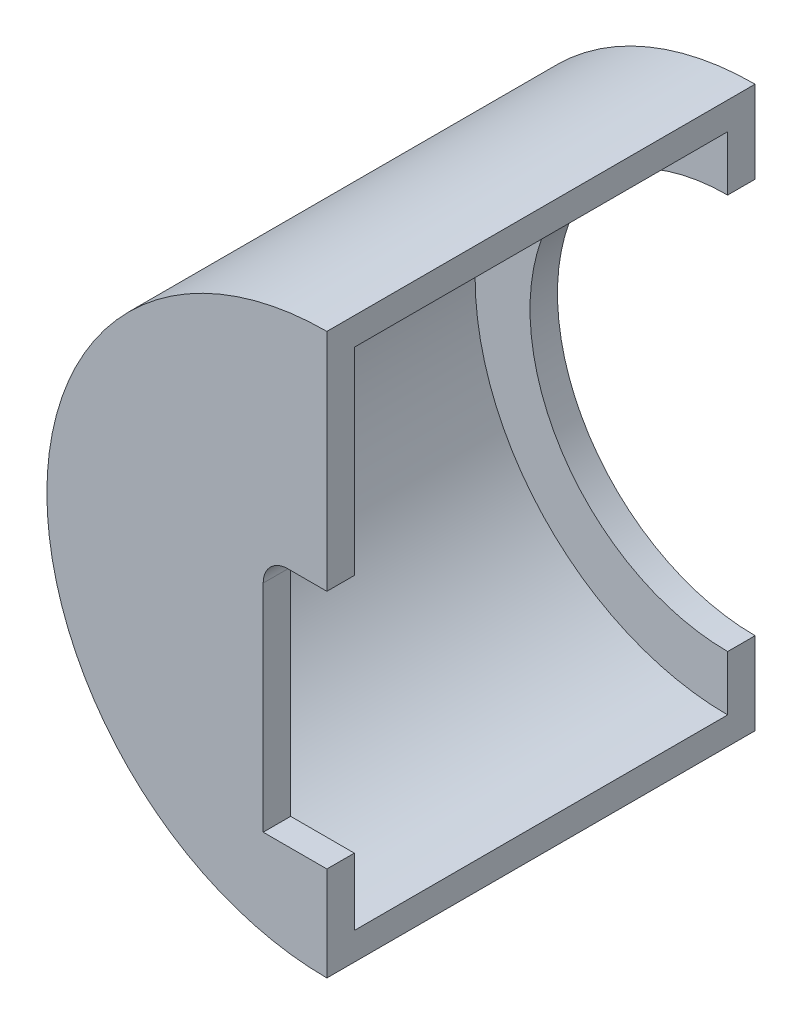
ISO-10303-21;
HEADER;
FILE_DESCRIPTION(('STEP AP214'),'2;1');
FILE_NAME('part.step','',(''),(''),'','','');
FILE_SCHEMA(('AUTOMOTIVE_DESIGN { 1 0 10303 214 1 1 1 1 }'));
ENDSEC;
DATA;
#1=APPLICATION_CONTEXT('core data for automotive mechanical design processes');
#2=APPLICATION_PROTOCOL_DEFINITION('international standard','automotive_design',2000,#1);
#3=PRODUCT_CONTEXT('',#1,'mechanical');
#4=PRODUCT('Part','Part','',(#3));
#5=PRODUCT_RELATED_PRODUCT_CATEGORY('part','',(#4));
#6=PRODUCT_DEFINITION_FORMATION('','',#4);
#7=PRODUCT_DEFINITION_CONTEXT('part definition',#1,'design');
#8=PRODUCT_DEFINITION('design','',#6,#7);
#9=PRODUCT_DEFINITION_SHAPE('','',#8);
#10=(LENGTH_UNIT() NAMED_UNIT(*) SI_UNIT(.MILLI.,.METRE.));
#11=(NAMED_UNIT(*) PLANE_ANGLE_UNIT() SI_UNIT($,.RADIAN.));
#12=(NAMED_UNIT(*) SI_UNIT($,.STERADIAN.) SOLID_ANGLE_UNIT());
#13=UNCERTAINTY_MEASURE_WITH_UNIT(LENGTH_MEASURE(1.E-05),#10,'distance_accuracy_value','');
#14=(GEOMETRIC_REPRESENTATION_CONTEXT(3) GLOBAL_UNCERTAINTY_ASSIGNED_CONTEXT((#13)) GLOBAL_UNIT_ASSIGNED_CONTEXT((#10,
#11,#12)) REPRESENTATION_CONTEXT('',''));
#15=CARTESIAN_POINT('',(0.,0.,0.));
#16=DIRECTION('',(0.,0.,1.));
#17=DIRECTION('',(1.,0.,0.));
#18=AXIS2_PLACEMENT_3D('',#15,#16,#17);
#19=CARTESIAN_POINT('',(0.,-46.,34.));
#20=DIRECTION('',(-1.,0.,0.));
#21=DIRECTION('',(0.,-1.,0.));
#22=AXIS2_PLACEMENT_3D('',#19,#20,#21);
#23=PLANE('',#22);
#24=DIRECTION('',(0.,0.,1.));
#25=VECTOR('',#24,1.);
#26=CARTESIAN_POINT('',(0.,10.000000044355,29.));
#27=LINE('',#26,#25);
#28=CARTESIAN_POINT('',(0.,10.000000044355,34.));
#29=VERTEX_POINT('',#28);
#30=CARTESIAN_POINT('',(0.,10.000000044355,39.));
#31=VERTEX_POINT('',#30);
#32=EDGE_CURVE('E79',#29,#31,#27,.T.);
#33=ORIENTED_EDGE('',*,*,#32,.F.);
#34=DIRECTION('',(0.,1.,0.));
#35=VECTOR('',#34,1.);
#36=CARTESIAN_POINT('',(0.,51.,34.));
#37=LINE('',#36,#35);
#38=CARTESIAN_POINT('',(0.,46.,34.));
#39=VERTEX_POINT('',#38);
#40=EDGE_CURVE('E65',#29,#39,#37,.T.);
#41=ORIENTED_EDGE('',*,*,#40,.T.);
#42=DIRECTION('',(0.,0.,-1.));
#43=VECTOR('',#42,1.);
#44=CARTESIAN_POINT('',(0.,46.,34.));
#45=LINE('',#44,#43);
#46=CARTESIAN_POINT('',(0.,46.,-34.));
#47=VERTEX_POINT('',#46);
#48=EDGE_CURVE('E12',#39,#47,#45,.T.);
#49=ORIENTED_EDGE('',*,*,#48,.T.);
#50=DIRECTION('',(0.,-1.,0.));
#51=VECTOR('',#50,1.);
#52=CARTESIAN_POINT('',(0.,51.,-34.));
#53=LINE('',#52,#51);
#54=CARTESIAN_POINT('',(0.,36.,-34.));
#55=VERTEX_POINT('',#54);
#56=EDGE_CURVE('E190',#47,#55,#53,.T.);
#57=ORIENTED_EDGE('',*,*,#56,.T.);
#58=DIRECTION('',(0.,0.,1.));
#59=VECTOR('',#58,1.);
#60=CARTESIAN_POINT('',(0.,36.,-39.));
#61=LINE('',#60,#59);
#62=CARTESIAN_POINT('',(0.,36.,-39.));
#63=VERTEX_POINT('',#62);
#64=EDGE_CURVE('E252',#63,#55,#61,.T.);
#65=ORIENTED_EDGE('',*,*,#64,.F.);
#66=DIRECTION('',(0.,-1.,0.));
#67=VECTOR('',#66,1.);
#68=CARTESIAN_POINT('',(0.,51.,-39.));
#69=LINE('',#68,#67);
#70=CARTESIAN_POINT('',(0.,51.,-39.));
#71=VERTEX_POINT('',#70);
#72=EDGE_CURVE('E194',#71,#63,#69,.T.);
#73=ORIENTED_EDGE('',*,*,#72,.F.);
#74=DIRECTION('',(0.,0.,-1.));
#75=VECTOR('',#74,1.);
#76=CARTESIAN_POINT('',(0.,51.,34.));
#77=LINE('',#76,#75);
#78=CARTESIAN_POINT('',(0.,51.,39.));
#79=VERTEX_POINT('',#78);
#80=EDGE_CURVE('E71',#79,#71,#77,.T.);
#81=ORIENTED_EDGE('',*,*,#80,.F.);
#82=DIRECTION('',(0.,1.,0.));
#83=VECTOR('',#82,1.);
#84=CARTESIAN_POINT('',(0.,51.,39.));
#85=LINE('',#84,#83);
#86=EDGE_CURVE('E214',#31,#79,#85,.T.);
#87=ORIENTED_EDGE('',*,*,#86,.F.);
#88=EDGE_LOOP('',(#33,#41,#49,#57,#65,#73,#81,#87));
#89=FACE_BOUND('',#88,.T.);
#90=ADVANCED_FACE('F61',(#89),#23,.F.);
#91=CARTESIAN_POINT('',(0.,-46.,34.));
#92=VERTEX_POINT('',#91);
#93=CARTESIAN_POINT('',(0.,-33.8,34.));
#94=VERTEX_POINT('',#93);
#95=EDGE_CURVE('E215',#92,#94,#37,.T.);
#96=ORIENTED_EDGE('',*,*,#95,.T.);
#97=DIRECTION('',(0.,0.,1.));
#98=VECTOR('',#97,1.);
#99=CARTESIAN_POINT('',(0.,-33.8,29.));
#100=LINE('',#99,#98);
#101=CARTESIAN_POINT('',(0.,-33.8,39.));
#102=VERTEX_POINT('',#101);
#103=EDGE_CURVE('E175',#94,#102,#100,.T.);
#104=ORIENTED_EDGE('',*,*,#103,.T.);
#105=CARTESIAN_POINT('',(0.,-51.,39.));
#106=VERTEX_POINT('',#105);
#107=EDGE_CURVE('E216',#106,#102,#85,.T.);
#108=ORIENTED_EDGE('',*,*,#107,.F.);
#109=DIRECTION('',(0.,0.,-1.));
#110=VECTOR('',#109,1.);
#111=CARTESIAN_POINT('',(0.,-51.,34.));
#112=LINE('',#111,#110);
#113=CARTESIAN_POINT('',(0.,-51.,-39.));
#114=VERTEX_POINT('',#113);
#115=EDGE_CURVE('E234',#106,#114,#112,.T.);
#116=ORIENTED_EDGE('',*,*,#115,.T.);
#117=DIRECTION('',(0.,-1.,0.));
#118=VECTOR('',#117,1.);
#119=CARTESIAN_POINT('',(0.,-51.,-39.));
#120=LINE('',#119,#118);
#121=CARTESIAN_POINT('',(0.,-36.,-39.));
#122=VERTEX_POINT('',#121);
#123=EDGE_CURVE('E199',#122,#114,#120,.T.);
#124=ORIENTED_EDGE('',*,*,#123,.F.);
#125=DIRECTION('',(0.,0.,1.));
#126=VECTOR('',#125,1.);
#127=CARTESIAN_POINT('',(0.,-36.,-39.));
#128=LINE('',#127,#126);
#129=CARTESIAN_POINT('',(0.,-36.,-34.));
#130=VERTEX_POINT('',#129);
#131=EDGE_CURVE('E202',#122,#130,#128,.T.);
#132=ORIENTED_EDGE('',*,*,#131,.T.);
#133=DIRECTION('',(0.,-1.,0.));
#134=VECTOR('',#133,1.);
#135=CARTESIAN_POINT('',(0.,-51.,-34.));
#136=LINE('',#135,#134);
#137=CARTESIAN_POINT('',(0.,-46.,-34.));
#138=VERTEX_POINT('',#137);
#139=EDGE_CURVE('E195',#130,#138,#136,.T.);
#140=ORIENTED_EDGE('',*,*,#139,.T.);
#141=DIRECTION('',(0.,0.,-1.));
#142=VECTOR('',#141,1.);
#143=CARTESIAN_POINT('',(0.,-46.,34.));
#144=LINE('',#143,#142);
#145=EDGE_CURVE('E88',#92,#138,#144,.T.);
#146=ORIENTED_EDGE('',*,*,#145,.F.);
#147=EDGE_LOOP('',(#96,#104,#108,#116,#124,#132,#140,#146));
#148=FACE_BOUND('',#147,.T.);
#149=ADVANCED_FACE('F244',(#148),#23,.F.);
#150=CARTESIAN_POINT('',(0.,0.,34.));
#151=DIRECTION('',(0.,0.,-1.));
#152=DIRECTION('',(-1.,0.,0.));
#153=AXIS2_PLACEMENT_3D('',#150,#151,#152);
#154=CYLINDRICAL_SURFACE('',#153,46.);
#155=CARTESIAN_POINT('',(0.,0.,-34.));
#156=DIRECTION('',(0.,0.,-1.));
#157=DIRECTION('',(1.,0.,0.));
#158=AXIS2_PLACEMENT_3D('',#155,#156,#157);
#159=CIRCLE('',#158,46.);
#160=EDGE_CURVE('E218',#138,#47,#159,.T.);
#161=ORIENTED_EDGE('',*,*,#160,.T.);
#162=ORIENTED_EDGE('',*,*,#48,.F.);
#163=CARTESIAN_POINT('',(0.,0.,34.));
#164=DIRECTION('',(0.,0.,-1.));
#165=DIRECTION('',(1.,0.,0.));
#166=AXIS2_PLACEMENT_3D('',#163,#164,#165);
#167=CIRCLE('',#166,46.);
#168=EDGE_CURVE('E228',#92,#39,#167,.T.);
#169=ORIENTED_EDGE('',*,*,#168,.F.);
#170=ORIENTED_EDGE('',*,*,#145,.T.);
#171=EDGE_LOOP('',(#161,#162,#169,#170));
#172=FACE_BOUND('',#171,.T.);
#173=ADVANCED_FACE('F63',(#172),#154,.F.);
#174=CARTESIAN_POINT('',(0.,0.,34.));
#175=DIRECTION('',(0.,0.,-1.));
#176=DIRECTION('',(-1.,0.,0.));
#177=AXIS2_PLACEMENT_3D('',#174,#175,#176);
#178=CYLINDRICAL_SURFACE('',#177,51.);
#179=ORIENTED_EDGE('',*,*,#80,.T.);
#180=CARTESIAN_POINT('',(0.,0.,-39.));
#181=DIRECTION('',(0.,0.,-1.));
#182=DIRECTION('',(-1.,0.,0.));
#183=AXIS2_PLACEMENT_3D('',#180,#181,#182);
#184=CIRCLE('',#183,51.);
#185=EDGE_CURVE('E191',#114,#71,#184,.T.);
#186=ORIENTED_EDGE('',*,*,#185,.F.);
#187=ORIENTED_EDGE('',*,*,#115,.F.);
#188=CARTESIAN_POINT('',(0.,0.,39.));
#189=DIRECTION('',(0.,0.,1.));
#190=DIRECTION('',(1.,0.,0.));
#191=AXIS2_PLACEMENT_3D('',#188,#189,#190);
#192=CIRCLE('',#191,51.);
#193=EDGE_CURVE('E211',#79,#106,#192,.T.);
#194=ORIENTED_EDGE('',*,*,#193,.F.);
#195=EDGE_LOOP('',(#179,#186,#187,#194));
#196=FACE_BOUND('',#195,.T.);
#197=ADVANCED_FACE('F267',(#196),#178,.T.);
#198=CARTESIAN_POINT('',(0.,0.,34.));
#199=DIRECTION('',(0.,0.,1.));
#200=DIRECTION('',(1.,0.,0.));
#201=AXIS2_PLACEMENT_3D('',#198,#199,#200);
#202=PLANE('',#201);
#203=DIRECTION('',(0.,1.,0.));
#204=VECTOR('',#203,1.);
#205=CARTESIAN_POINT('',(-11.59999996,0.,34.));
#206=LINE('',#205,#204);
#207=CARTESIAN_POINT('',(-11.59999996,-33.8,34.));
#208=VERTEX_POINT('',#207);
#209=CARTESIAN_POINT('',(-11.59999996,5.499999955645,34.));
#210=VERTEX_POINT('',#209);
#211=EDGE_CURVE('E185',#208,#210,#206,.T.);
#212=ORIENTED_EDGE('',*,*,#211,.F.);
#213=DIRECTION('',(1.,0.,0.));
#214=VECTOR('',#213,1.);
#215=CARTESIAN_POINT('',(0.,-33.8,34.));
#216=LINE('',#215,#214);
#217=EDGE_CURVE('E187',#208,#94,#216,.T.);
#218=ORIENTED_EDGE('',*,*,#217,.T.);
#219=ORIENTED_EDGE('',*,*,#95,.F.);
#220=ORIENTED_EDGE('',*,*,#168,.T.);
#221=ORIENTED_EDGE('',*,*,#40,.F.);
#222=DIRECTION('',(1.,0.,0.));
#223=VECTOR('',#222,1.);
#224=CARTESIAN_POINT('',(0.,10.000000044355,34.));
#225=LINE('',#224,#223);
#226=CARTESIAN_POINT('',(-7.09999987129,10.000000044355,34.));
#227=VERTEX_POINT('',#226);
#228=EDGE_CURVE('E178',#227,#29,#225,.T.);
#229=ORIENTED_EDGE('',*,*,#228,.F.);
#230=CARTESIAN_POINT('',(-7.09999987129,5.499999955645,34.));
#231=DIRECTION('',(0.,0.,1.));
#232=DIRECTION('',(1.,0.,0.));
#233=AXIS2_PLACEMENT_3D('',#230,#231,#232);
#234=CIRCLE('',#233,4.50000008871);
#235=EDGE_CURVE('E157',#210,#227,#234,.F.);
#236=ORIENTED_EDGE('',*,*,#235,.F.);
#237=EDGE_LOOP('',(#212,#218,#219,#220,#221,#229,#236));
#238=FACE_BOUND('',#237,.T.);
#239=ADVANCED_FACE('F260',(#238),#202,.F.);
#240=CARTESIAN_POINT('',(0.,0.,39.));
#241=DIRECTION('',(0.,0.,1.));
#242=DIRECTION('',(1.,0.,0.));
#243=AXIS2_PLACEMENT_3D('',#240,#241,#242);
#244=PLANE('',#243);
#245=DIRECTION('',(1.,0.,0.));
#246=VECTOR('',#245,1.);
#247=CARTESIAN_POINT('',(0.,-33.8,39.));
#248=LINE('',#247,#246);
#249=CARTESIAN_POINT('',(-11.59999996,-33.8,39.));
#250=VERTEX_POINT('',#249);
#251=EDGE_CURVE('E171',#250,#102,#248,.T.);
#252=ORIENTED_EDGE('',*,*,#251,.F.);
#253=DIRECTION('',(0.,1.,0.));
#254=VECTOR('',#253,1.);
#255=CARTESIAN_POINT('',(-11.59999996,0.,39.));
#256=LINE('',#255,#254);
#257=CARTESIAN_POINT('',(-11.59999996,5.499999955645,39.));
#258=VERTEX_POINT('',#257);
#259=EDGE_CURVE('E169',#250,#258,#256,.T.);
#260=ORIENTED_EDGE('',*,*,#259,.T.);
#261=CARTESIAN_POINT('',(-7.09999987129,5.499999955645,39.));
#262=DIRECTION('',(0.,0.,1.));
#263=DIRECTION('',(1.,0.,0.));
#264=AXIS2_PLACEMENT_3D('',#261,#262,#263);
#265=CIRCLE('',#264,4.50000008871);
#266=CARTESIAN_POINT('',(-7.09999987129,10.000000044355,39.));
#267=VERTEX_POINT('',#266);
#268=EDGE_CURVE('E154',#258,#267,#265,.F.);
#269=ORIENTED_EDGE('',*,*,#268,.T.);
#270=DIRECTION('',(1.,0.,0.));
#271=VECTOR('',#270,1.);
#272=CARTESIAN_POINT('',(0.,10.000000044355,39.));
#273=LINE('',#272,#271);
#274=EDGE_CURVE('E161',#267,#31,#273,.T.);
#275=ORIENTED_EDGE('',*,*,#274,.T.);
#276=ORIENTED_EDGE('',*,*,#86,.T.);
#277=ORIENTED_EDGE('',*,*,#193,.T.);
#278=ORIENTED_EDGE('',*,*,#107,.T.);
#279=EDGE_LOOP('',(#252,#260,#269,#275,#276,#277,#278));
#280=FACE_BOUND('',#279,.T.);
#281=ADVANCED_FACE('F167',(#280),#244,.T.);
#282=CARTESIAN_POINT('',(0.,0.,-39.));
#283=DIRECTION('',(0.,0.,1.));
#284=DIRECTION('',(1.,0.,0.));
#285=AXIS2_PLACEMENT_3D('',#282,#283,#284);
#286=CYLINDRICAL_SURFACE('',#285,36.);
#287=CARTESIAN_POINT('',(0.,0.,-34.));
#288=DIRECTION('',(0.,0.,1.));
#289=DIRECTION('',(-1.,0.,0.));
#290=AXIS2_PLACEMENT_3D('',#287,#288,#289);
#291=CIRCLE('',#290,36.);
#292=EDGE_CURVE('E205',#55,#130,#291,.T.);
#293=ORIENTED_EDGE('',*,*,#292,.T.);
#294=ORIENTED_EDGE('',*,*,#131,.F.);
#295=CARTESIAN_POINT('',(0.,0.,-39.));
#296=DIRECTION('',(0.,0.,1.));
#297=DIRECTION('',(-1.,0.,0.));
#298=AXIS2_PLACEMENT_3D('',#295,#296,#297);
#299=CIRCLE('',#298,36.);
#300=EDGE_CURVE('E197',#63,#122,#299,.T.);
#301=ORIENTED_EDGE('',*,*,#300,.F.);
#302=ORIENTED_EDGE('',*,*,#64,.T.);
#303=EDGE_LOOP('',(#293,#294,#301,#302));
#304=FACE_BOUND('',#303,.T.);
#305=ADVANCED_FACE('F249',(#304),#286,.F.);
#306=CARTESIAN_POINT('',(0.,0.,-39.));
#307=DIRECTION('',(0.,0.,-1.));
#308=DIRECTION('',(-1.,0.,0.));
#309=AXIS2_PLACEMENT_3D('',#306,#307,#308);
#310=PLANE('',#309);
#311=ORIENTED_EDGE('',*,*,#185,.T.);
#312=ORIENTED_EDGE('',*,*,#72,.T.);
#313=ORIENTED_EDGE('',*,*,#300,.T.);
#314=ORIENTED_EDGE('',*,*,#123,.T.);
#315=EDGE_LOOP('',(#311,#312,#313,#314));
#316=FACE_BOUND('',#315,.T.);
#317=ADVANCED_FACE('F271',(#316),#310,.T.);
#318=CARTESIAN_POINT('',(0.,0.,-34.));
#319=DIRECTION('',(0.,0.,-1.));
#320=DIRECTION('',(-1.,0.,0.));
#321=AXIS2_PLACEMENT_3D('',#318,#319,#320);
#322=PLANE('',#321);
#323=ORIENTED_EDGE('',*,*,#160,.F.);
#324=ORIENTED_EDGE('',*,*,#139,.F.);
#325=ORIENTED_EDGE('',*,*,#292,.F.);
#326=ORIENTED_EDGE('',*,*,#56,.F.);
#327=EDGE_LOOP('',(#323,#324,#325,#326));
#328=FACE_BOUND('',#327,.T.);
#329=ADVANCED_FACE('F241',(#328),#322,.F.);
#330=CARTESIAN_POINT('',(0.,-33.8,29.));
#331=DIRECTION('',(0.,-1.,0.));
#332=DIRECTION('',(0.,0.,-1.));
#333=AXIS2_PLACEMENT_3D('',#330,#331,#332);
#334=PLANE('',#333);
#335=DIRECTION('',(0.,0.,1.));
#336=VECTOR('',#335,1.);
#337=CARTESIAN_POINT('',(-11.59999996,-33.8,29.));
#338=LINE('',#337,#336);
#339=EDGE_CURVE('E179',#208,#250,#338,.T.);
#340=ORIENTED_EDGE('',*,*,#339,.T.);
#341=ORIENTED_EDGE('',*,*,#251,.T.);
#342=ORIENTED_EDGE('',*,*,#103,.F.);
#343=ORIENTED_EDGE('',*,*,#217,.F.);
#344=EDGE_LOOP('',(#340,#341,#342,#343));
#345=FACE_BOUND('',#344,.T.);
#346=ADVANCED_FACE('F278',(#345),#334,.F.);
#347=CARTESIAN_POINT('',(-11.59999996,0.,29.));
#348=DIRECTION('',(1.,0.,0.));
#349=DIRECTION('',(0.,0.,-1.));
#350=AXIS2_PLACEMENT_3D('',#347,#348,#349);
#351=PLANE('',#350);
#352=ORIENTED_EDGE('',*,*,#211,.T.);
#353=DIRECTION('',(0.,0.,1.));
#354=VECTOR('',#353,1.);
#355=CARTESIAN_POINT('',(-11.59999996,5.499999955645,29.));
#356=LINE('',#355,#354);
#357=EDGE_CURVE('E159',#210,#258,#356,.T.);
#358=ORIENTED_EDGE('',*,*,#357,.T.);
#359=ORIENTED_EDGE('',*,*,#259,.F.);
#360=ORIENTED_EDGE('',*,*,#339,.F.);
#361=EDGE_LOOP('',(#352,#358,#359,#360));
#362=FACE_BOUND('',#361,.T.);
#363=ADVANCED_FACE('F342',(#362),#351,.T.);
#364=CARTESIAN_POINT('',(-7.09999987129,5.499999955645,29.));
#365=DIRECTION('',(0.,0.,1.));
#366=DIRECTION('',(1.,0.,0.));
#367=AXIS2_PLACEMENT_3D('',#364,#365,#366);
#368=CYLINDRICAL_SURFACE('',#367,4.50000008871);
#369=ORIENTED_EDGE('',*,*,#235,.T.);
#370=DIRECTION('',(0.,0.,1.));
#371=VECTOR('',#370,1.);
#372=CARTESIAN_POINT('',(-7.09999987129,10.000000044355,29.));
#373=LINE('',#372,#371);
#374=EDGE_CURVE('E150',#227,#267,#373,.T.);
#375=ORIENTED_EDGE('',*,*,#374,.T.);
#376=ORIENTED_EDGE('',*,*,#268,.F.);
#377=ORIENTED_EDGE('',*,*,#357,.F.);
#378=EDGE_LOOP('',(#369,#375,#376,#377));
#379=FACE_BOUND('',#378,.T.);
#380=ADVANCED_FACE('F151',(#379),#368,.F.);
#381=CARTESIAN_POINT('',(0.,10.000000044355,29.));
#382=DIRECTION('',(0.,-1.,0.));
#383=DIRECTION('',(0.,0.,-1.));
#384=AXIS2_PLACEMENT_3D('',#381,#382,#383);
#385=PLANE('',#384);
#386=ORIENTED_EDGE('',*,*,#228,.T.);
#387=ORIENTED_EDGE('',*,*,#32,.T.);
#388=ORIENTED_EDGE('',*,*,#274,.F.);
#389=ORIENTED_EDGE('',*,*,#374,.F.);
#390=EDGE_LOOP('',(#386,#387,#388,#389));
#391=FACE_BOUND('',#390,.T.);
#392=ADVANCED_FACE('F162',(#391),#385,.T.);
#393=CLOSED_SHELL('',(#90,#149,#173,#197,#239,#281,#305,#317,#329,#346,#363,#380,#392));
#394=MANIFOLD_SOLID_BREP('B2',#393);
#395=ADVANCED_BREP_SHAPE_REPRESENTATION('',(#18,#394),#14);
#396=SHAPE_DEFINITION_REPRESENTATION(#9,#395);
ENDSEC;
END-ISO-10303-21;
